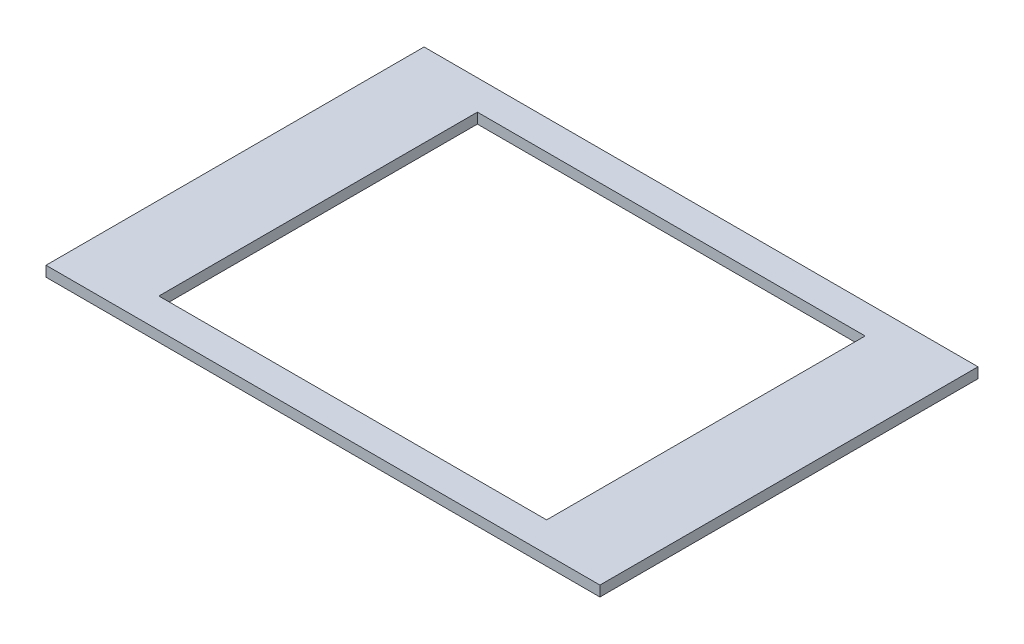
ISO-10303-21;
HEADER;
FILE_DESCRIPTION(('STEP AP214'),'2;1');
FILE_NAME('part.step','',(''),(''),'','','');
FILE_SCHEMA(('AUTOMOTIVE_DESIGN { 1 0 10303 214 1 1 1 1 }'));
ENDSEC;
DATA;
#1=APPLICATION_CONTEXT('core data for automotive mechanical design processes');
#2=APPLICATION_PROTOCOL_DEFINITION('international standard','automotive_design',2000,#1);
#3=PRODUCT_CONTEXT('',#1,'mechanical');
#4=PRODUCT('Part','Part','',(#3));
#5=PRODUCT_RELATED_PRODUCT_CATEGORY('part','',(#4));
#6=PRODUCT_DEFINITION_FORMATION('','',#4);
#7=PRODUCT_DEFINITION_CONTEXT('part definition',#1,'design');
#8=PRODUCT_DEFINITION('design','',#6,#7);
#9=PRODUCT_DEFINITION_SHAPE('','',#8);
#10=(LENGTH_UNIT() NAMED_UNIT(*) SI_UNIT(.MILLI.,.METRE.));
#11=(NAMED_UNIT(*) PLANE_ANGLE_UNIT() SI_UNIT($,.RADIAN.));
#12=(NAMED_UNIT(*) SI_UNIT($,.STERADIAN.) SOLID_ANGLE_UNIT());
#13=UNCERTAINTY_MEASURE_WITH_UNIT(LENGTH_MEASURE(1.E-05),#10,'distance_accuracy_value','');
#14=(GEOMETRIC_REPRESENTATION_CONTEXT(3) GLOBAL_UNCERTAINTY_ASSIGNED_CONTEXT((#13)) GLOBAL_UNIT_ASSIGNED_CONTEXT((#10,
#11,#12)) REPRESENTATION_CONTEXT('',''));
#15=CARTESIAN_POINT('',(0.,0.,0.));
#16=DIRECTION('',(0.,0.,1.));
#17=DIRECTION('',(1.,0.,0.));
#18=AXIS2_PLACEMENT_3D('',#15,#16,#17);
#19=CARTESIAN_POINT('',(-127.,4.7625,86.6775));
#20=DIRECTION('',(0.,-1.,0.));
#21=DIRECTION('',(0.,0.,-1.));
#22=AXIS2_PLACEMENT_3D('',#19,#20,#21);
#23=PLANE('',#22);
#24=DIRECTION('',(0.,0.,1.));
#25=VECTOR('',#24,1.);
#26=CARTESIAN_POINT('',(-127.,4.7625,-86.6775));
#27=LINE('',#26,#25);
#28=CARTESIAN_POINT('',(-127.,4.7625,-86.6775));
#29=VERTEX_POINT('',#28);
#30=CARTESIAN_POINT('',(-127.,4.7625,86.6775));
#31=VERTEX_POINT('',#30);
#32=EDGE_CURVE('E133',#29,#31,#27,.T.);
#33=ORIENTED_EDGE('',*,*,#32,.T.);
#34=DIRECTION('',(1.,0.,0.));
#35=VECTOR('',#34,1.);
#36=CARTESIAN_POINT('',(127.,4.7625,86.6775));
#37=LINE('',#36,#35);
#38=CARTESIAN_POINT('',(127.,4.7625,86.6775));
#39=VERTEX_POINT('',#38);
#40=EDGE_CURVE('E136',#31,#39,#37,.T.);
#41=ORIENTED_EDGE('',*,*,#40,.T.);
#42=DIRECTION('',(0.,0.,-1.));
#43=VECTOR('',#42,1.);
#44=CARTESIAN_POINT('',(127.,4.7625,-86.6775));
#45=LINE('',#44,#43);
#46=CARTESIAN_POINT('',(127.,4.7625,-86.6775));
#47=VERTEX_POINT('',#46);
#48=EDGE_CURVE('E139',#39,#47,#45,.T.);
#49=ORIENTED_EDGE('',*,*,#48,.T.);
#50=DIRECTION('',(-1.,0.,0.));
#51=VECTOR('',#50,1.);
#52=CARTESIAN_POINT('',(127.,4.7625,-86.6775));
#53=LINE('',#52,#51);
#54=EDGE_CURVE('E141',#47,#29,#53,.T.);
#55=ORIENTED_EDGE('',*,*,#54,.T.);
#56=EDGE_LOOP('',(#33,#41,#49,#55));
#57=FACE_BOUND('',#56,.T.);
#58=DIRECTION('',(0.,0.,1.));
#59=VECTOR('',#58,1.);
#60=CARTESIAN_POINT('',(-88.8999999999999,4.7625,-73.025));
#61=LINE('',#60,#59);
#62=CARTESIAN_POINT('',(-88.8999999999999,4.7625,-73.025));
#63=VERTEX_POINT('',#62);
#64=CARTESIAN_POINT('',(-88.8999999999999,4.7625,73.025));
#65=VERTEX_POINT('',#64);
#66=EDGE_CURVE('E97',#63,#65,#61,.T.);
#67=ORIENTED_EDGE('',*,*,#66,.F.);
#68=DIRECTION('',(-1.,0.,0.));
#69=VECTOR('',#68,1.);
#70=CARTESIAN_POINT('',(88.9,4.7625,-73.025));
#71=LINE('',#70,#69);
#72=CARTESIAN_POINT('',(88.9,4.7625,-73.025));
#73=VERTEX_POINT('',#72);
#74=EDGE_CURVE('E119',#73,#63,#71,.T.);
#75=ORIENTED_EDGE('',*,*,#74,.F.);
#76=DIRECTION('',(0.,0.,-1.));
#77=VECTOR('',#76,1.);
#78=CARTESIAN_POINT('',(88.9,4.7625,-73.025));
#79=LINE('',#78,#77);
#80=CARTESIAN_POINT('',(88.9,4.7625,73.025));
#81=VERTEX_POINT('',#80);
#82=EDGE_CURVE('E117',#81,#73,#79,.T.);
#83=ORIENTED_EDGE('',*,*,#82,.F.);
#84=DIRECTION('',(1.,0.,0.));
#85=VECTOR('',#84,1.);
#86=CARTESIAN_POINT('',(88.9,4.7625,73.025));
#87=LINE('',#86,#85);
#88=EDGE_CURVE('E105',#65,#81,#87,.T.);
#89=ORIENTED_EDGE('',*,*,#88,.F.);
#90=EDGE_LOOP('',(#67,#75,#83,#89));
#91=FACE_BOUND('',#90,.T.);
#92=ADVANCED_FACE('F32',(#57,#91),#23,.F.);
#93=CARTESIAN_POINT('',(-127.,0.,86.6775));
#94=DIRECTION('',(0.,-1.,0.));
#95=DIRECTION('',(0.,0.,-1.));
#96=AXIS2_PLACEMENT_3D('',#93,#94,#95);
#97=PLANE('',#96);
#98=DIRECTION('',(0.,0.,1.));
#99=VECTOR('',#98,1.);
#100=CARTESIAN_POINT('',(-127.,0.,-86.6775));
#101=LINE('',#100,#99);
#102=CARTESIAN_POINT('',(-127.,0.,-86.6775));
#103=VERTEX_POINT('',#102);
#104=CARTESIAN_POINT('',(-127.,0.,86.6775));
#105=VERTEX_POINT('',#104);
#106=EDGE_CURVE('E113',#103,#105,#101,.T.);
#107=ORIENTED_EDGE('',*,*,#106,.F.);
#108=DIRECTION('',(-1.,0.,0.));
#109=VECTOR('',#108,1.);
#110=CARTESIAN_POINT('',(127.,0.,-86.6775));
#111=LINE('',#110,#109);
#112=CARTESIAN_POINT('',(127.,0.,-86.6775));
#113=VERTEX_POINT('',#112);
#114=EDGE_CURVE('E137',#113,#103,#111,.T.);
#115=ORIENTED_EDGE('',*,*,#114,.F.);
#116=DIRECTION('',(0.,0.,-1.));
#117=VECTOR('',#116,1.);
#118=CARTESIAN_POINT('',(127.,0.,-86.6775));
#119=LINE('',#118,#117);
#120=CARTESIAN_POINT('',(127.,0.,86.6775));
#121=VERTEX_POINT('',#120);
#122=EDGE_CURVE('E148',#121,#113,#119,.T.);
#123=ORIENTED_EDGE('',*,*,#122,.F.);
#124=DIRECTION('',(1.,0.,0.));
#125=VECTOR('',#124,1.);
#126=CARTESIAN_POINT('',(127.,0.,86.6775));
#127=LINE('',#126,#125);
#128=EDGE_CURVE('E146',#105,#121,#127,.T.);
#129=ORIENTED_EDGE('',*,*,#128,.F.);
#130=EDGE_LOOP('',(#107,#115,#123,#129));
#131=FACE_BOUND('',#130,.T.);
#132=DIRECTION('',(-1.,0.,0.));
#133=VECTOR('',#132,1.);
#134=CARTESIAN_POINT('',(88.9,0.,-73.025));
#135=LINE('',#134,#133);
#136=CARTESIAN_POINT('',(88.9,0.,-73.025));
#137=VERTEX_POINT('',#136);
#138=CARTESIAN_POINT('',(-88.8999999999999,0.,-73.025));
#139=VERTEX_POINT('',#138);
#140=EDGE_CURVE('E106',#137,#139,#135,.T.);
#141=ORIENTED_EDGE('',*,*,#140,.T.);
#142=DIRECTION('',(0.,0.,1.));
#143=VECTOR('',#142,1.);
#144=CARTESIAN_POINT('',(-88.8999999999999,0.,-73.025));
#145=LINE('',#144,#143);
#146=CARTESIAN_POINT('',(-88.8999999999999,0.,73.025));
#147=VERTEX_POINT('',#146);
#148=EDGE_CURVE('E55',#139,#147,#145,.T.);
#149=ORIENTED_EDGE('',*,*,#148,.T.);
#150=DIRECTION('',(1.,0.,0.));
#151=VECTOR('',#150,1.);
#152=CARTESIAN_POINT('',(88.9,0.,73.025));
#153=LINE('',#152,#151);
#154=CARTESIAN_POINT('',(88.9,0.,73.025));
#155=VERTEX_POINT('',#154);
#156=EDGE_CURVE('E112',#147,#155,#153,.T.);
#157=ORIENTED_EDGE('',*,*,#156,.T.);
#158=DIRECTION('',(0.,0.,-1.));
#159=VECTOR('',#158,1.);
#160=CARTESIAN_POINT('',(88.9,0.,-73.025));
#161=LINE('',#160,#159);
#162=EDGE_CURVE('E125',#155,#137,#161,.T.);
#163=ORIENTED_EDGE('',*,*,#162,.T.);
#164=EDGE_LOOP('',(#141,#149,#157,#163));
#165=FACE_BOUND('',#164,.T.);
#166=ADVANCED_FACE('F166',(#131,#165),#97,.T.);
#167=CARTESIAN_POINT('',(-127.,4.7625,-86.6775));
#168=DIRECTION('',(1.,0.,0.));
#169=DIRECTION('',(0.,0.,-1.));
#170=AXIS2_PLACEMENT_3D('',#167,#168,#169);
#171=PLANE('',#170);
#172=ORIENTED_EDGE('',*,*,#106,.T.);
#173=DIRECTION('',(0.,-1.,0.));
#174=VECTOR('',#173,1.);
#175=CARTESIAN_POINT('',(-127.,4.7625,86.6775));
#176=LINE('',#175,#174);
#177=EDGE_CURVE('E11',#31,#105,#176,.T.);
#178=ORIENTED_EDGE('',*,*,#177,.F.);
#179=ORIENTED_EDGE('',*,*,#32,.F.);
#180=DIRECTION('',(0.,-1.,0.));
#181=VECTOR('',#180,1.);
#182=CARTESIAN_POINT('',(-127.,4.7625,-86.6775));
#183=LINE('',#182,#181);
#184=EDGE_CURVE('E143',#29,#103,#183,.T.);
#185=ORIENTED_EDGE('',*,*,#184,.T.);
#186=EDGE_LOOP('',(#172,#178,#179,#185));
#187=FACE_BOUND('',#186,.T.);
#188=ADVANCED_FACE('F34',(#187),#171,.F.);
#189=CARTESIAN_POINT('',(127.,4.7625,86.6775));
#190=DIRECTION('',(0.,0.,-1.));
#191=DIRECTION('',(-1.,0.,0.));
#192=AXIS2_PLACEMENT_3D('',#189,#190,#191);
#193=PLANE('',#192);
#194=ORIENTED_EDGE('',*,*,#128,.T.);
#195=DIRECTION('',(0.,-1.,0.));
#196=VECTOR('',#195,1.);
#197=CARTESIAN_POINT('',(127.,4.7625,86.6775));
#198=LINE('',#197,#196);
#199=EDGE_CURVE('E40',#39,#121,#198,.T.);
#200=ORIENTED_EDGE('',*,*,#199,.F.);
#201=ORIENTED_EDGE('',*,*,#40,.F.);
#202=ORIENTED_EDGE('',*,*,#177,.T.);
#203=EDGE_LOOP('',(#194,#200,#201,#202));
#204=FACE_BOUND('',#203,.T.);
#205=ADVANCED_FACE('F176',(#204),#193,.F.);
#206=CARTESIAN_POINT('',(127.,4.7625,-86.6775));
#207=DIRECTION('',(-1.,0.,0.));
#208=DIRECTION('',(0.,0.,1.));
#209=AXIS2_PLACEMENT_3D('',#206,#207,#208);
#210=PLANE('',#209);
#211=ORIENTED_EDGE('',*,*,#122,.T.);
#212=DIRECTION('',(0.,-1.,0.));
#213=VECTOR('',#212,1.);
#214=CARTESIAN_POINT('',(127.,4.7625,-86.6775));
#215=LINE('',#214,#213);
#216=EDGE_CURVE('E153',#47,#113,#215,.T.);
#217=ORIENTED_EDGE('',*,*,#216,.F.);
#218=ORIENTED_EDGE('',*,*,#48,.F.);
#219=ORIENTED_EDGE('',*,*,#199,.T.);
#220=EDGE_LOOP('',(#211,#217,#218,#219));
#221=FACE_BOUND('',#220,.T.);
#222=ADVANCED_FACE('F160',(#221),#210,.F.);
#223=CARTESIAN_POINT('',(127.,4.7625,-86.6775));
#224=DIRECTION('',(0.,0.,1.));
#225=DIRECTION('',(1.,0.,0.));
#226=AXIS2_PLACEMENT_3D('',#223,#224,#225);
#227=PLANE('',#226);
#228=ORIENTED_EDGE('',*,*,#114,.T.);
#229=ORIENTED_EDGE('',*,*,#184,.F.);
#230=ORIENTED_EDGE('',*,*,#54,.F.);
#231=ORIENTED_EDGE('',*,*,#216,.T.);
#232=EDGE_LOOP('',(#228,#229,#230,#231));
#233=FACE_BOUND('',#232,.T.);
#234=ADVANCED_FACE('F170',(#233),#227,.F.);
#235=CARTESIAN_POINT('',(-88.8999999999999,4.7625,-73.025));
#236=DIRECTION('',(1.,0.,0.));
#237=DIRECTION('',(0.,0.,-1.));
#238=AXIS2_PLACEMENT_3D('',#235,#236,#237);
#239=PLANE('',#238);
#240=ORIENTED_EDGE('',*,*,#148,.F.);
#241=DIRECTION('',(0.,-1.,0.));
#242=VECTOR('',#241,1.);
#243=CARTESIAN_POINT('',(-88.8999999999999,4.7625,-73.025));
#244=LINE('',#243,#242);
#245=EDGE_CURVE('E101',#63,#139,#244,.T.);
#246=ORIENTED_EDGE('',*,*,#245,.F.);
#247=ORIENTED_EDGE('',*,*,#66,.T.);
#248=DIRECTION('',(0.,-1.,0.));
#249=VECTOR('',#248,1.);
#250=CARTESIAN_POINT('',(-88.8999999999999,4.7625,73.025));
#251=LINE('',#250,#249);
#252=EDGE_CURVE('E100',#65,#147,#251,.T.);
#253=ORIENTED_EDGE('',*,*,#252,.T.);
#254=EDGE_LOOP('',(#240,#246,#247,#253));
#255=FACE_BOUND('',#254,.T.);
#256=ADVANCED_FACE('F99',(#255),#239,.T.);
#257=CARTESIAN_POINT('',(88.9,4.7625,73.025));
#258=DIRECTION('',(0.,0.,-1.));
#259=DIRECTION('',(-1.,0.,0.));
#260=AXIS2_PLACEMENT_3D('',#257,#258,#259);
#261=PLANE('',#260);
#262=ORIENTED_EDGE('',*,*,#156,.F.);
#263=ORIENTED_EDGE('',*,*,#252,.F.);
#264=ORIENTED_EDGE('',*,*,#88,.T.);
#265=DIRECTION('',(0.,-1.,0.));
#266=VECTOR('',#265,1.);
#267=CARTESIAN_POINT('',(88.9,4.7625,73.025));
#268=LINE('',#267,#266);
#269=EDGE_CURVE('E114',#81,#155,#268,.T.);
#270=ORIENTED_EDGE('',*,*,#269,.T.);
#271=EDGE_LOOP('',(#262,#263,#264,#270));
#272=FACE_BOUND('',#271,.T.);
#273=ADVANCED_FACE('F109',(#272),#261,.T.);
#274=CARTESIAN_POINT('',(88.9,4.7625,-73.025));
#275=DIRECTION('',(-1.,0.,0.));
#276=DIRECTION('',(0.,0.,1.));
#277=AXIS2_PLACEMENT_3D('',#274,#275,#276);
#278=PLANE('',#277);
#279=ORIENTED_EDGE('',*,*,#162,.F.);
#280=ORIENTED_EDGE('',*,*,#269,.F.);
#281=ORIENTED_EDGE('',*,*,#82,.T.);
#282=DIRECTION('',(0.,-1.,0.));
#283=VECTOR('',#282,1.);
#284=CARTESIAN_POINT('',(88.9,4.7625,-73.025));
#285=LINE('',#284,#283);
#286=EDGE_CURVE('E47',#73,#137,#285,.T.);
#287=ORIENTED_EDGE('',*,*,#286,.T.);
#288=EDGE_LOOP('',(#279,#280,#281,#287));
#289=FACE_BOUND('',#288,.T.);
#290=ADVANCED_FACE('F199',(#289),#278,.T.);
#291=CARTESIAN_POINT('',(88.9,4.7625,-73.025));
#292=DIRECTION('',(0.,0.,1.));
#293=DIRECTION('',(1.,0.,0.));
#294=AXIS2_PLACEMENT_3D('',#291,#292,#293);
#295=PLANE('',#294);
#296=ORIENTED_EDGE('',*,*,#140,.F.);
#297=ORIENTED_EDGE('',*,*,#286,.F.);
#298=ORIENTED_EDGE('',*,*,#74,.T.);
#299=ORIENTED_EDGE('',*,*,#245,.T.);
#300=EDGE_LOOP('',(#296,#297,#298,#299));
#301=FACE_BOUND('',#300,.T.);
#302=ADVANCED_FACE('F203',(#301),#295,.T.);
#303=CLOSED_SHELL('',(#92,#166,#188,#205,#222,#234,#256,#273,#290,#302));
#304=MANIFOLD_SOLID_BREP('B2',#303);
#305=ADVANCED_BREP_SHAPE_REPRESENTATION('',(#18,#304),#14);
#306=SHAPE_DEFINITION_REPRESENTATION(#9,#305);
ENDSEC;
END-ISO-10303-21;
